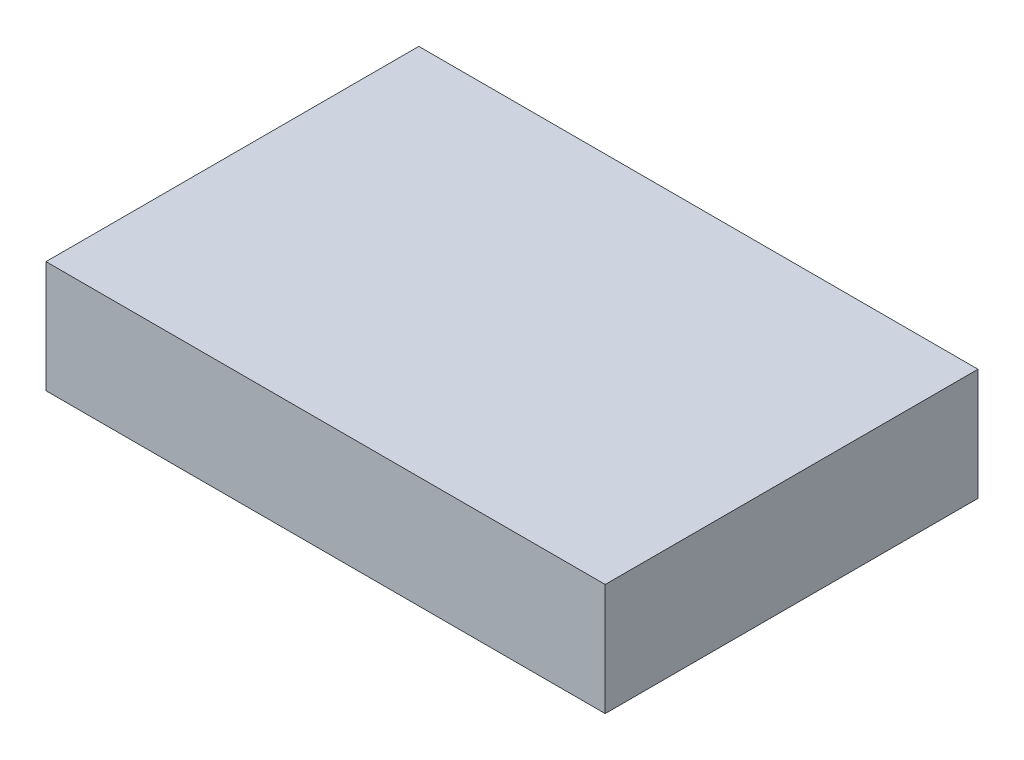
ISO-10303-21;
HEADER;
FILE_DESCRIPTION(('STEP AP214'),'2;1');
FILE_NAME('part.step','',(''),(''),'','','');
FILE_SCHEMA(('AUTOMOTIVE_DESIGN { 1 0 10303 214 1 1 1 1 }'));
ENDSEC;
DATA;
#1=APPLICATION_CONTEXT('core data for automotive mechanical design processes');
#2=APPLICATION_PROTOCOL_DEFINITION('international standard','automotive_design',2000,#1);
#3=PRODUCT_CONTEXT('',#1,'mechanical');
#4=PRODUCT('Part','Part','',(#3));
#5=PRODUCT_RELATED_PRODUCT_CATEGORY('part','',(#4));
#6=PRODUCT_DEFINITION_FORMATION('','',#4);
#7=PRODUCT_DEFINITION_CONTEXT('part definition',#1,'design');
#8=PRODUCT_DEFINITION('design','',#6,#7);
#9=PRODUCT_DEFINITION_SHAPE('','',#8);
#10=(LENGTH_UNIT() NAMED_UNIT(*) SI_UNIT(.MILLI.,.METRE.));
#11=(NAMED_UNIT(*) PLANE_ANGLE_UNIT() SI_UNIT($,.RADIAN.));
#12=(NAMED_UNIT(*) SI_UNIT($,.STERADIAN.) SOLID_ANGLE_UNIT());
#13=UNCERTAINTY_MEASURE_WITH_UNIT(LENGTH_MEASURE(1.E-05),#10,'distance_accuracy_value','');
#14=(GEOMETRIC_REPRESENTATION_CONTEXT(3) GLOBAL_UNCERTAINTY_ASSIGNED_CONTEXT((#13)) GLOBAL_UNIT_ASSIGNED_CONTEXT((#10,
#11,#12)) REPRESENTATION_CONTEXT('',''));
#15=CARTESIAN_POINT('',(0.,0.,0.));
#16=DIRECTION('',(0.,0.,1.));
#17=DIRECTION('',(1.,0.,0.));
#18=AXIS2_PLACEMENT_3D('',#15,#16,#17);
#19=CARTESIAN_POINT('',(75.,30.,-50.));
#20=DIRECTION('',(-1.,0.,0.));
#21=DIRECTION('',(0.,0.,1.));
#22=AXIS2_PLACEMENT_3D('',#19,#20,#21);
#23=PLANE('',#22);
#24=DIRECTION('',(0.,0.,-1.));
#25=VECTOR('',#24,1.);
#26=CARTESIAN_POINT('',(75.,0.,-50.));
#27=LINE('',#26,#25);
#28=CARTESIAN_POINT('',(75.,0.,50.));
#29=VERTEX_POINT('',#28);
#30=CARTESIAN_POINT('',(75.,0.,-50.));
#31=VERTEX_POINT('',#30);
#32=EDGE_CURVE('E100',#29,#31,#27,.T.);
#33=ORIENTED_EDGE('',*,*,#32,.T.);
#34=DIRECTION('',(0.,-1.,0.));
#35=VECTOR('',#34,1.);
#36=CARTESIAN_POINT('',(75.,30.,-50.));
#37=LINE('',#36,#35);
#38=CARTESIAN_POINT('',(75.,30.,-50.));
#39=VERTEX_POINT('',#38);
#40=EDGE_CURVE('E11',#39,#31,#37,.T.);
#41=ORIENTED_EDGE('',*,*,#40,.F.);
#42=DIRECTION('',(0.,0.,-1.));
#43=VECTOR('',#42,1.);
#44=CARTESIAN_POINT('',(75.,30.,-50.));
#45=LINE('',#44,#43);
#46=CARTESIAN_POINT('',(75.,30.,50.));
#47=VERTEX_POINT('',#46);
#48=EDGE_CURVE('E88',#47,#39,#45,.T.);
#49=ORIENTED_EDGE('',*,*,#48,.F.);
#50=DIRECTION('',(0.,-1.,0.));
#51=VECTOR('',#50,1.);
#52=CARTESIAN_POINT('',(75.,30.,50.));
#53=LINE('',#52,#51);
#54=EDGE_CURVE('E96',#47,#29,#53,.T.);
#55=ORIENTED_EDGE('',*,*,#54,.T.);
#56=EDGE_LOOP('',(#33,#41,#49,#55));
#57=FACE_BOUND('',#56,.T.);
#58=ADVANCED_FACE('F37',(#57),#23,.F.);
#59=CARTESIAN_POINT('',(-75.,30.,-50.));
#60=DIRECTION('',(0.,0.,1.));
#61=DIRECTION('',(1.,0.,0.));
#62=AXIS2_PLACEMENT_3D('',#59,#60,#61);
#63=PLANE('',#62);
#64=DIRECTION('',(-1.,0.,0.));
#65=VECTOR('',#64,1.);
#66=CARTESIAN_POINT('',(-75.,0.,-50.));
#67=LINE('',#66,#65);
#68=CARTESIAN_POINT('',(-75.,0.,-50.));
#69=VERTEX_POINT('',#68);
#70=EDGE_CURVE('E92',#31,#69,#67,.T.);
#71=ORIENTED_EDGE('',*,*,#70,.T.);
#72=DIRECTION('',(0.,-1.,0.));
#73=VECTOR('',#72,1.);
#74=CARTESIAN_POINT('',(-75.,30.,-50.));
#75=LINE('',#74,#73);
#76=CARTESIAN_POINT('',(-75.,30.,-50.));
#77=VERTEX_POINT('',#76);
#78=EDGE_CURVE('E45',#77,#69,#75,.T.);
#79=ORIENTED_EDGE('',*,*,#78,.F.);
#80=DIRECTION('',(-1.,0.,0.));
#81=VECTOR('',#80,1.);
#82=CARTESIAN_POINT('',(-75.,30.,-50.));
#83=LINE('',#82,#81);
#84=EDGE_CURVE('E83',#39,#77,#83,.T.);
#85=ORIENTED_EDGE('',*,*,#84,.F.);
#86=ORIENTED_EDGE('',*,*,#40,.T.);
#87=EDGE_LOOP('',(#71,#79,#85,#86));
#88=FACE_BOUND('',#87,.T.);
#89=ADVANCED_FACE('F91',(#88),#63,.F.);
#90=CARTESIAN_POINT('',(-75.,30.,-50.));
#91=DIRECTION('',(1.,0.,0.));
#92=DIRECTION('',(0.,0.,-1.));
#93=AXIS2_PLACEMENT_3D('',#90,#91,#92);
#94=PLANE('',#93);
#95=DIRECTION('',(0.,0.,1.));
#96=VECTOR('',#95,1.);
#97=CARTESIAN_POINT('',(-75.,0.,-50.));
#98=LINE('',#97,#96);
#99=CARTESIAN_POINT('',(-75.,0.,50.));
#100=VERTEX_POINT('',#99);
#101=EDGE_CURVE('E70',#69,#100,#98,.T.);
#102=ORIENTED_EDGE('',*,*,#101,.T.);
#103=DIRECTION('',(0.,-1.,0.));
#104=VECTOR('',#103,1.);
#105=CARTESIAN_POINT('',(-75.,30.,50.));
#106=LINE('',#105,#104);
#107=CARTESIAN_POINT('',(-75.,30.,50.));
#108=VERTEX_POINT('',#107);
#109=EDGE_CURVE('E93',#108,#100,#106,.T.);
#110=ORIENTED_EDGE('',*,*,#109,.F.);
#111=DIRECTION('',(0.,0.,1.));
#112=VECTOR('',#111,1.);
#113=CARTESIAN_POINT('',(-75.,30.,-50.));
#114=LINE('',#113,#112);
#115=EDGE_CURVE('E86',#77,#108,#114,.T.);
#116=ORIENTED_EDGE('',*,*,#115,.F.);
#117=ORIENTED_EDGE('',*,*,#78,.T.);
#118=EDGE_LOOP('',(#102,#110,#116,#117));
#119=FACE_BOUND('',#118,.T.);
#120=ADVANCED_FACE('F94',(#119),#94,.F.);
#121=CARTESIAN_POINT('',(-75.,30.,50.));
#122=DIRECTION('',(0.,0.,-1.));
#123=DIRECTION('',(-1.,0.,0.));
#124=AXIS2_PLACEMENT_3D('',#121,#122,#123);
#125=PLANE('',#124);
#126=DIRECTION('',(1.,0.,0.));
#127=VECTOR('',#126,1.);
#128=CARTESIAN_POINT('',(-75.,0.,50.));
#129=LINE('',#128,#127);
#130=EDGE_CURVE('E76',#100,#29,#129,.T.);
#131=ORIENTED_EDGE('',*,*,#130,.T.);
#132=ORIENTED_EDGE('',*,*,#54,.F.);
#133=DIRECTION('',(1.,0.,0.));
#134=VECTOR('',#133,1.);
#135=CARTESIAN_POINT('',(-75.,30.,50.));
#136=LINE('',#135,#134);
#137=EDGE_CURVE('E53',#108,#47,#136,.T.);
#138=ORIENTED_EDGE('',*,*,#137,.F.);
#139=ORIENTED_EDGE('',*,*,#109,.T.);
#140=EDGE_LOOP('',(#131,#132,#138,#139));
#141=FACE_BOUND('',#140,.T.);
#142=ADVANCED_FACE('F107',(#141),#125,.F.);
#143=CARTESIAN_POINT('',(0.,30.,0.));
#144=DIRECTION('',(0.,1.,0.));
#145=DIRECTION('',(0.,0.,1.));
#146=AXIS2_PLACEMENT_3D('',#143,#144,#145);
#147=PLANE('',#146);
#148=ORIENTED_EDGE('',*,*,#48,.T.);
#149=ORIENTED_EDGE('',*,*,#84,.T.);
#150=ORIENTED_EDGE('',*,*,#115,.T.);
#151=ORIENTED_EDGE('',*,*,#137,.T.);
#152=EDGE_LOOP('',(#148,#149,#150,#151));
#153=FACE_BOUND('',#152,.T.);
#154=ADVANCED_FACE('F84',(#153),#147,.T.);
#155=CARTESIAN_POINT('',(0.,0.,0.));
#156=DIRECTION('',(0.,1.,0.));
#157=DIRECTION('',(0.,0.,1.));
#158=AXIS2_PLACEMENT_3D('',#155,#156,#157);
#159=PLANE('',#158);
#160=ORIENTED_EDGE('',*,*,#32,.F.);
#161=ORIENTED_EDGE('',*,*,#130,.F.);
#162=ORIENTED_EDGE('',*,*,#101,.F.);
#163=ORIENTED_EDGE('',*,*,#70,.F.);
#164=EDGE_LOOP('',(#160,#161,#162,#163));
#165=FACE_BOUND('',#164,.T.);
#166=ADVANCED_FACE('F110',(#165),#159,.F.);
#167=CLOSED_SHELL('',(#58,#89,#120,#142,#154,#166));
#168=MANIFOLD_SOLID_BREP('B2',#167);
#169=ADVANCED_BREP_SHAPE_REPRESENTATION('',(#18,#168),#14);
#170=SHAPE_DEFINITION_REPRESENTATION(#9,#169);
ENDSEC;
END-ISO-10303-21;
